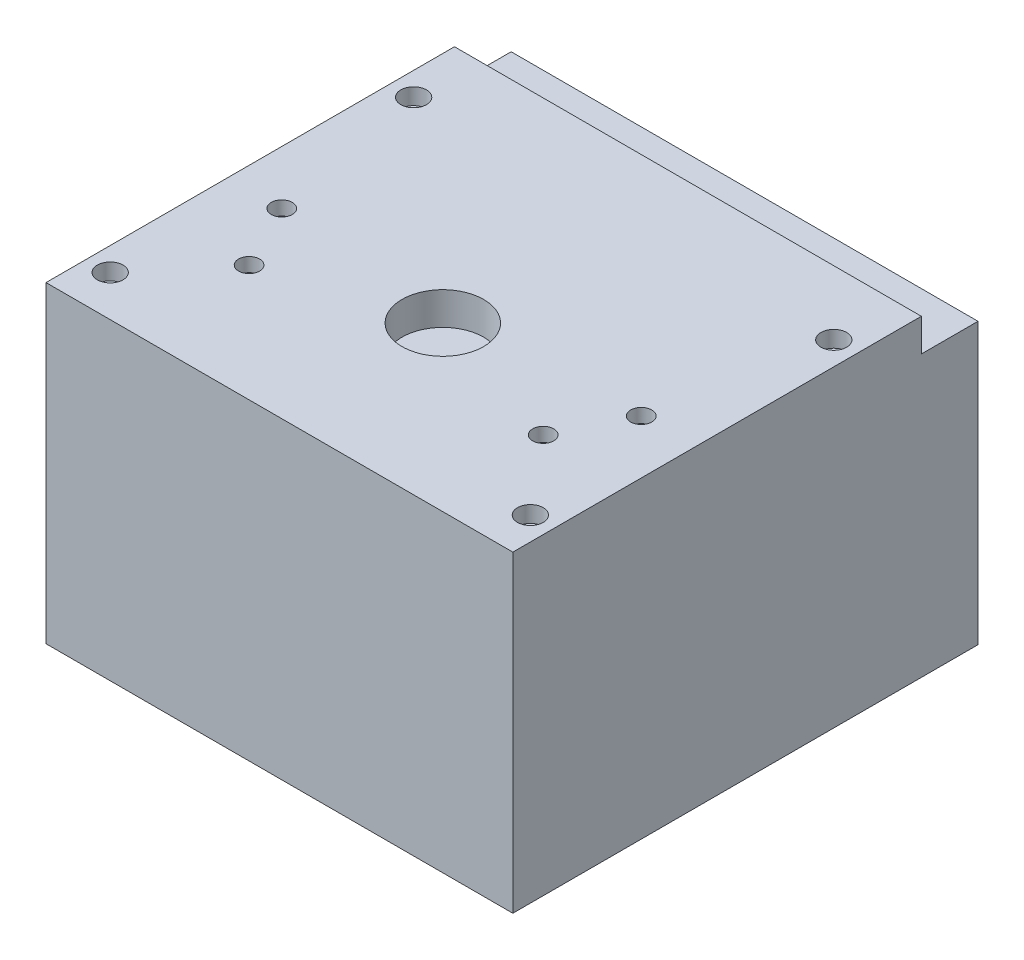
ISO-10303-21;
HEADER;
FILE_DESCRIPTION(('STEP AP214'),'2;1');
FILE_NAME('part.step','',(''),(''),'','','');
FILE_SCHEMA(('AUTOMOTIVE_DESIGN { 1 0 10303 214 1 1 1 1 }'));
ENDSEC;
DATA;
#1=APPLICATION_CONTEXT('core data for automotive mechanical design processes');
#2=APPLICATION_PROTOCOL_DEFINITION('international standard','automotive_design',2000,#1);
#3=PRODUCT_CONTEXT('',#1,'mechanical');
#4=PRODUCT('Part','Part','',(#3));
#5=PRODUCT_RELATED_PRODUCT_CATEGORY('part','',(#4));
#6=PRODUCT_DEFINITION_FORMATION('','',#4);
#7=PRODUCT_DEFINITION_CONTEXT('part definition',#1,'design');
#8=PRODUCT_DEFINITION('design','',#6,#7);
#9=PRODUCT_DEFINITION_SHAPE('','',#8);
#10=(LENGTH_UNIT() NAMED_UNIT(*) SI_UNIT(.MILLI.,.METRE.));
#11=(NAMED_UNIT(*) PLANE_ANGLE_UNIT() SI_UNIT($,.RADIAN.));
#12=(NAMED_UNIT(*) SI_UNIT($,.STERADIAN.) SOLID_ANGLE_UNIT());
#13=UNCERTAINTY_MEASURE_WITH_UNIT(LENGTH_MEASURE(1.E-05),#10,'distance_accuracy_value','');
#14=(GEOMETRIC_REPRESENTATION_CONTEXT(3) GLOBAL_UNCERTAINTY_ASSIGNED_CONTEXT((#13)) GLOBAL_UNIT_ASSIGNED_CONTEXT((#10,
#11,#12)) REPRESENTATION_CONTEXT('',''));
#15=CARTESIAN_POINT('',(0.,0.,0.));
#16=DIRECTION('',(0.,0.,1.));
#17=DIRECTION('',(1.,0.,0.));
#18=AXIS2_PLACEMENT_3D('',#15,#16,#17);
#19=CARTESIAN_POINT('',(90.,14.,-52.5));
#20=DIRECTION('',(0.,-1.,0.));
#21=DIRECTION('',(0.,0.,-1.));
#22=AXIS2_PLACEMENT_3D('',#19,#20,#21);
#23=CYLINDRICAL_SURFACE('',#22,3.25);
#24=CARTESIAN_POINT('',(90.,7.,-52.5));
#25=DIRECTION('',(0.,-1.,0.));
#26=DIRECTION('',(0.,0.,-1.));
#27=AXIS2_PLACEMENT_3D('',#24,#25,#26);
#28=CIRCLE('',#27,3.25);
#29=CARTESIAN_POINT('',(90.,7.,-55.75));
#30=VERTEX_POINT('',#29);
#31=EDGE_CURVE('E183',#30,#30,#28,.T.);
#32=ORIENTED_EDGE('',*,*,#31,.F.);
#33=EDGE_LOOP('',(#32));
#34=FACE_BOUND('',#33,.T.);
#35=CARTESIAN_POINT('',(90.,0.,-52.5));
#36=DIRECTION('',(0.,-1.,0.));
#37=DIRECTION('',(0.,0.,-1.));
#38=AXIS2_PLACEMENT_3D('',#35,#36,#37);
#39=CIRCLE('',#38,3.25);
#40=CARTESIAN_POINT('',(90.,0.,-55.75));
#41=VERTEX_POINT('',#40);
#42=EDGE_CURVE('E205',#41,#41,#39,.T.);
#43=ORIENTED_EDGE('',*,*,#42,.T.);
#44=EDGE_LOOP('',(#43));
#45=FACE_BOUND('',#44,.T.);
#46=ADVANCED_FACE('F37',(#34,#45),#23,.F.);
#47=CARTESIAN_POINT('',(90.,14.,77.5));
#48=DIRECTION('',(0.,-1.,0.));
#49=DIRECTION('',(0.,0.,-1.));
#50=AXIS2_PLACEMENT_3D('',#47,#48,#49);
#51=CYLINDRICAL_SURFACE('',#50,3.25);
#52=CARTESIAN_POINT('',(90.,7.,77.5));
#53=DIRECTION('',(0.,-1.,0.));
#54=DIRECTION('',(0.,0.,-1.));
#55=AXIS2_PLACEMENT_3D('',#52,#53,#54);
#56=CIRCLE('',#55,3.25);
#57=CARTESIAN_POINT('',(90.,7.,74.25));
#58=VERTEX_POINT('',#57);
#59=EDGE_CURVE('E186',#58,#58,#56,.T.);
#60=ORIENTED_EDGE('',*,*,#59,.F.);
#61=EDGE_LOOP('',(#60));
#62=FACE_BOUND('',#61,.T.);
#63=CARTESIAN_POINT('',(90.,0.,77.5));
#64=DIRECTION('',(0.,-1.,0.));
#65=DIRECTION('',(0.,0.,-1.));
#66=AXIS2_PLACEMENT_3D('',#63,#64,#65);
#67=CIRCLE('',#66,3.25);
#68=CARTESIAN_POINT('',(90.,0.,74.25));
#69=VERTEX_POINT('',#68);
#70=EDGE_CURVE('E208',#69,#69,#67,.T.);
#71=ORIENTED_EDGE('',*,*,#70,.T.);
#72=EDGE_LOOP('',(#71));
#73=FACE_BOUND('',#72,.T.);
#74=ADVANCED_FACE('F465',(#62,#73),#51,.F.);
#75=CARTESIAN_POINT('',(-90.,14.,77.5));
#76=DIRECTION('',(0.,-1.,0.));
#77=DIRECTION('',(0.,0.,-1.));
#78=AXIS2_PLACEMENT_3D('',#75,#76,#77);
#79=CYLINDRICAL_SURFACE('',#78,3.25);
#80=CARTESIAN_POINT('',(-90.,7.,77.5));
#81=DIRECTION('',(0.,-1.,0.));
#82=DIRECTION('',(0.,0.,-1.));
#83=AXIS2_PLACEMENT_3D('',#80,#81,#82);
#84=CIRCLE('',#83,3.25);
#85=CARTESIAN_POINT('',(-90.,7.,74.25));
#86=VERTEX_POINT('',#85);
#87=EDGE_CURVE('E189',#86,#86,#84,.T.);
#88=ORIENTED_EDGE('',*,*,#87,.F.);
#89=EDGE_LOOP('',(#88));
#90=FACE_BOUND('',#89,.T.);
#91=CARTESIAN_POINT('',(-90.,0.,77.5));
#92=DIRECTION('',(0.,-1.,0.));
#93=DIRECTION('',(0.,0.,-1.));
#94=AXIS2_PLACEMENT_3D('',#91,#92,#93);
#95=CIRCLE('',#94,3.25);
#96=CARTESIAN_POINT('',(-90.,0.,74.25));
#97=VERTEX_POINT('',#96);
#98=EDGE_CURVE('E211',#97,#97,#95,.T.);
#99=ORIENTED_EDGE('',*,*,#98,.T.);
#100=EDGE_LOOP('',(#99));
#101=FACE_BOUND('',#100,.T.);
#102=ADVANCED_FACE('F455',(#90,#101),#79,.F.);
#103=CARTESIAN_POINT('',(-89.99999999999,14.,-52.5));
#104=DIRECTION('',(0.,-1.,0.));
#105=DIRECTION('',(0.,0.,-1.));
#106=AXIS2_PLACEMENT_3D('',#103,#104,#105);
#107=CYLINDRICAL_SURFACE('',#106,3.25);
#108=CARTESIAN_POINT('',(-89.99999999999,7.,-52.5));
#109=DIRECTION('',(0.,-1.,0.));
#110=DIRECTION('',(0.,0.,-1.));
#111=AXIS2_PLACEMENT_3D('',#108,#109,#110);
#112=CIRCLE('',#111,3.25);
#113=CARTESIAN_POINT('',(-89.99999999999,7.,-55.75));
#114=VERTEX_POINT('',#113);
#115=EDGE_CURVE('E180',#114,#114,#112,.T.);
#116=ORIENTED_EDGE('',*,*,#115,.F.);
#117=EDGE_LOOP('',(#116));
#118=FACE_BOUND('',#117,.T.);
#119=CARTESIAN_POINT('',(-89.99999999999,0.,-52.5));
#120=DIRECTION('',(0.,-1.,0.));
#121=DIRECTION('',(0.,0.,-1.));
#122=AXIS2_PLACEMENT_3D('',#119,#120,#121);
#123=CIRCLE('',#122,3.25);
#124=CARTESIAN_POINT('',(-89.99999999999,0.,-55.75));
#125=VERTEX_POINT('',#124);
#126=EDGE_CURVE('E214',#125,#125,#123,.T.);
#127=ORIENTED_EDGE('',*,*,#126,.T.);
#128=EDGE_LOOP('',(#127));
#129=FACE_BOUND('',#128,.T.);
#130=ADVANCED_FACE('F445',(#118,#129),#107,.F.);
#131=CARTESIAN_POINT('',(-77.,0.,17.));
#132=DIRECTION('',(0.,-1.,0.));
#133=DIRECTION('',(0.,0.,-1.));
#134=AXIS2_PLACEMENT_3D('',#131,#132,#133);
#135=CYLINDRICAL_SURFACE('',#134,7.5);
#136=CARTESIAN_POINT('',(-77.,8.,17.));
#137=DIRECTION('',(0.,-1.,0.));
#138=DIRECTION('',(0.,0.,-1.));
#139=AXIS2_PLACEMENT_3D('',#136,#137,#138);
#140=CIRCLE('',#139,7.5);
#141=CARTESIAN_POINT('',(-77.,8.,9.5));
#142=VERTEX_POINT('',#141);
#143=EDGE_CURVE('E192',#142,#142,#140,.F.);
#144=ORIENTED_EDGE('',*,*,#143,.T.);
#145=EDGE_LOOP('',(#144));
#146=FACE_BOUND('',#145,.T.);
#147=CARTESIAN_POINT('',(-77.,0.,17.));
#148=DIRECTION('',(0.,-1.,0.));
#149=DIRECTION('',(0.,0.,-1.));
#150=AXIS2_PLACEMENT_3D('',#147,#148,#149);
#151=CIRCLE('',#150,7.5);
#152=CARTESIAN_POINT('',(-77.,0.,9.5));
#153=VERTEX_POINT('',#152);
#154=EDGE_CURVE('E217',#153,#153,#151,.T.);
#155=ORIENTED_EDGE('',*,*,#154,.T.);
#156=EDGE_LOOP('',(#155));
#157=FACE_BOUND('',#156,.T.);
#158=ADVANCED_FACE('F435',(#146,#157),#135,.F.);
#159=CARTESIAN_POINT('',(77.,0.,17.));
#160=DIRECTION('',(0.,-1.,0.));
#161=DIRECTION('',(0.,0.,-1.));
#162=AXIS2_PLACEMENT_3D('',#159,#160,#161);
#163=CYLINDRICAL_SURFACE('',#162,7.5);
#164=CARTESIAN_POINT('',(77.,8.,17.));
#165=DIRECTION('',(0.,-1.,0.));
#166=DIRECTION('',(0.,0.,-1.));
#167=AXIS2_PLACEMENT_3D('',#164,#165,#166);
#168=CIRCLE('',#167,7.5);
#169=CARTESIAN_POINT('',(77.,8.,9.5));
#170=VERTEX_POINT('',#169);
#171=EDGE_CURVE('E195',#170,#170,#168,.F.);
#172=ORIENTED_EDGE('',*,*,#171,.T.);
#173=EDGE_LOOP('',(#172));
#174=FACE_BOUND('',#173,.T.);
#175=CARTESIAN_POINT('',(77.,0.,17.));
#176=DIRECTION('',(0.,-1.,0.));
#177=DIRECTION('',(0.,0.,-1.));
#178=AXIS2_PLACEMENT_3D('',#175,#176,#177);
#179=CIRCLE('',#178,7.5);
#180=CARTESIAN_POINT('',(77.,0.,9.5));
#181=VERTEX_POINT('',#180);
#182=EDGE_CURVE('E220',#181,#181,#179,.T.);
#183=ORIENTED_EDGE('',*,*,#182,.T.);
#184=EDGE_LOOP('',(#183));
#185=FACE_BOUND('',#184,.T.);
#186=ADVANCED_FACE('F425',(#174,#185),#163,.F.);
#187=CARTESIAN_POINT('',(63.,0.,45.));
#188=DIRECTION('',(0.,-1.,0.));
#189=DIRECTION('',(0.,0.,-1.));
#190=AXIS2_PLACEMENT_3D('',#187,#188,#189);
#191=CYLINDRICAL_SURFACE('',#190,7.5);
#192=CARTESIAN_POINT('',(63.,8.,45.));
#193=DIRECTION('',(0.,-1.,0.));
#194=DIRECTION('',(0.,0.,-1.));
#195=AXIS2_PLACEMENT_3D('',#192,#193,#194);
#196=CIRCLE('',#195,7.5);
#197=CARTESIAN_POINT('',(63.,8.,37.5));
#198=VERTEX_POINT('',#197);
#199=EDGE_CURVE('E198',#198,#198,#196,.F.);
#200=ORIENTED_EDGE('',*,*,#199,.T.);
#201=EDGE_LOOP('',(#200));
#202=FACE_BOUND('',#201,.T.);
#203=CARTESIAN_POINT('',(63.,0.,45.));
#204=DIRECTION('',(0.,-1.,0.));
#205=DIRECTION('',(0.,0.,-1.));
#206=AXIS2_PLACEMENT_3D('',#203,#204,#205);
#207=CIRCLE('',#206,7.5);
#208=CARTESIAN_POINT('',(63.,0.,37.5));
#209=VERTEX_POINT('',#208);
#210=EDGE_CURVE('E223',#209,#209,#207,.T.);
#211=ORIENTED_EDGE('',*,*,#210,.T.);
#212=EDGE_LOOP('',(#211));
#213=FACE_BOUND('',#212,.T.);
#214=ADVANCED_FACE('F414',(#202,#213),#191,.F.);
#215=CARTESIAN_POINT('',(-63.,0.,45.));
#216=DIRECTION('',(0.,-1.,0.));
#217=DIRECTION('',(0.,0.,-1.));
#218=AXIS2_PLACEMENT_3D('',#215,#216,#217);
#219=CYLINDRICAL_SURFACE('',#218,7.5);
#220=CARTESIAN_POINT('',(-63.,8.,45.));
#221=DIRECTION('',(0.,-1.,0.));
#222=DIRECTION('',(0.,0.,-1.));
#223=AXIS2_PLACEMENT_3D('',#220,#221,#222);
#224=CIRCLE('',#223,7.5);
#225=CARTESIAN_POINT('',(-63.,8.,37.5));
#226=VERTEX_POINT('',#225);
#227=EDGE_CURVE('E201',#226,#226,#224,.F.);
#228=ORIENTED_EDGE('',*,*,#227,.T.);
#229=EDGE_LOOP('',(#228));
#230=FACE_BOUND('',#229,.T.);
#231=CARTESIAN_POINT('',(-63.,0.,45.));
#232=DIRECTION('',(0.,-1.,0.));
#233=DIRECTION('',(0.,0.,-1.));
#234=AXIS2_PLACEMENT_3D('',#231,#232,#233);
#235=CIRCLE('',#234,7.5);
#236=CARTESIAN_POINT('',(-63.,0.,37.5));
#237=VERTEX_POINT('',#236);
#238=EDGE_CURVE('E226',#237,#237,#235,.T.);
#239=ORIENTED_EDGE('',*,*,#238,.T.);
#240=EDGE_LOOP('',(#239));
#241=FACE_BOUND('',#240,.T.);
#242=ADVANCED_FACE('F408',(#230,#241),#219,.F.);
#243=CARTESIAN_POINT('',(-89.99999999999,7.,-52.5));
#244=DIRECTION('',(0.,1.,0.));
#245=DIRECTION('',(0.,0.,1.));
#246=AXIS2_PLACEMENT_3D('',#243,#244,#245);
#247=PLANE('',#246);
#248=CARTESIAN_POINT('',(-89.99999999999,7.,-52.5));
#249=DIRECTION('',(0.,1.,0.));
#250=DIRECTION('',(0.,0.,1.));
#251=AXIS2_PLACEMENT_3D('',#248,#249,#250);
#252=CIRCLE('',#251,5.5);
#253=CARTESIAN_POINT('',(-89.99999999999,7.,-47.));
#254=VERTEX_POINT('',#253);
#255=EDGE_CURVE('E204',#254,#254,#252,.T.);
#256=ORIENTED_EDGE('',*,*,#255,.T.);
#257=EDGE_LOOP('',(#256));
#258=FACE_BOUND('',#257,.T.);
#259=ORIENTED_EDGE('',*,*,#115,.T.);
#260=EDGE_LOOP('',(#259));
#261=FACE_BOUND('',#260,.T.);
#262=ADVANCED_FACE('F413',(#258,#261),#247,.T.);
#263=CARTESIAN_POINT('',(90.,7.,-52.5));
#264=DIRECTION('',(0.,1.,0.));
#265=DIRECTION('',(0.,0.,1.));
#266=AXIS2_PLACEMENT_3D('',#263,#264,#265);
#267=PLANE('',#266);
#268=CARTESIAN_POINT('',(90.,7.,-52.5));
#269=DIRECTION('',(0.,1.,0.));
#270=DIRECTION('',(0.,0.,1.));
#271=AXIS2_PLACEMENT_3D('',#268,#269,#270);
#272=CIRCLE('',#271,5.5);
#273=CARTESIAN_POINT('',(90.,7.,-47.));
#274=VERTEX_POINT('',#273);
#275=EDGE_CURVE('E244',#274,#274,#272,.T.);
#276=ORIENTED_EDGE('',*,*,#275,.T.);
#277=EDGE_LOOP('',(#276));
#278=FACE_BOUND('',#277,.T.);
#279=ORIENTED_EDGE('',*,*,#31,.T.);
#280=EDGE_LOOP('',(#279));
#281=FACE_BOUND('',#280,.T.);
#282=ADVANCED_FACE('F637',(#278,#281),#267,.T.);
#283=CARTESIAN_POINT('',(90.,7.,77.5));
#284=DIRECTION('',(0.,1.,0.));
#285=DIRECTION('',(0.,0.,1.));
#286=AXIS2_PLACEMENT_3D('',#283,#284,#285);
#287=PLANE('',#286);
#288=CARTESIAN_POINT('',(90.,7.,77.5));
#289=DIRECTION('',(0.,1.,0.));
#290=DIRECTION('',(0.,0.,1.));
#291=AXIS2_PLACEMENT_3D('',#288,#289,#290);
#292=CIRCLE('',#291,5.50000000000001);
#293=CARTESIAN_POINT('',(90.,7.,83.));
#294=VERTEX_POINT('',#293);
#295=EDGE_CURVE('E247',#294,#294,#292,.T.);
#296=ORIENTED_EDGE('',*,*,#295,.T.);
#297=EDGE_LOOP('',(#296));
#298=FACE_BOUND('',#297,.T.);
#299=ORIENTED_EDGE('',*,*,#59,.T.);
#300=EDGE_LOOP('',(#299));
#301=FACE_BOUND('',#300,.T.);
#302=ADVANCED_FACE('F641',(#298,#301),#287,.T.);
#303=CARTESIAN_POINT('',(-90.,7.,77.5));
#304=DIRECTION('',(0.,1.,0.));
#305=DIRECTION('',(0.,0.,1.));
#306=AXIS2_PLACEMENT_3D('',#303,#304,#305);
#307=PLANE('',#306);
#308=CARTESIAN_POINT('',(-90.,7.,77.5));
#309=DIRECTION('',(0.,1.,0.));
#310=DIRECTION('',(0.,0.,1.));
#311=AXIS2_PLACEMENT_3D('',#308,#309,#310);
#312=CIRCLE('',#311,5.50000000000001);
#313=CARTESIAN_POINT('',(-90.,7.,83.));
#314=VERTEX_POINT('',#313);
#315=EDGE_CURVE('E250',#314,#314,#312,.T.);
#316=ORIENTED_EDGE('',*,*,#315,.T.);
#317=EDGE_LOOP('',(#316));
#318=FACE_BOUND('',#317,.T.);
#319=ORIENTED_EDGE('',*,*,#87,.T.);
#320=EDGE_LOOP('',(#319));
#321=FACE_BOUND('',#320,.T.);
#322=ADVANCED_FACE('F645',(#318,#321),#307,.T.);
#323=CARTESIAN_POINT('',(-72.5,8.,17.));
#324=DIRECTION('',(0.,1.,0.));
#325=DIRECTION('',(0.,0.,1.));
#326=AXIS2_PLACEMENT_3D('',#323,#324,#325);
#327=PLANE('',#326);
#328=ORIENTED_EDGE('',*,*,#143,.F.);
#329=EDGE_LOOP('',(#328));
#330=FACE_BOUND('',#329,.T.);
#331=CARTESIAN_POINT('',(-77.,8.,17.));
#332=DIRECTION('',(0.,-1.,0.));
#333=DIRECTION('',(0.,0.,-1.));
#334=AXIS2_PLACEMENT_3D('',#331,#332,#333);
#335=CIRCLE('',#334,4.5);
#336=CARTESIAN_POINT('',(-77.,8.,12.5));
#337=VERTEX_POINT('',#336);
#338=EDGE_CURVE('E253',#337,#337,#335,.F.);
#339=ORIENTED_EDGE('',*,*,#338,.T.);
#340=EDGE_LOOP('',(#339));
#341=FACE_BOUND('',#340,.T.);
#342=ADVANCED_FACE('F649',(#330,#341),#327,.F.);
#343=CARTESIAN_POINT('',(81.5,8.,17.));
#344=DIRECTION('',(0.,1.,0.));
#345=DIRECTION('',(0.,0.,1.));
#346=AXIS2_PLACEMENT_3D('',#343,#344,#345);
#347=PLANE('',#346);
#348=ORIENTED_EDGE('',*,*,#171,.F.);
#349=EDGE_LOOP('',(#348));
#350=FACE_BOUND('',#349,.T.);
#351=CARTESIAN_POINT('',(77.,8.,17.));
#352=DIRECTION('',(0.,-1.,0.));
#353=DIRECTION('',(0.,0.,-1.));
#354=AXIS2_PLACEMENT_3D('',#351,#352,#353);
#355=CIRCLE('',#354,4.5);
#356=CARTESIAN_POINT('',(77.,8.,12.5));
#357=VERTEX_POINT('',#356);
#358=EDGE_CURVE('E256',#357,#357,#355,.F.);
#359=ORIENTED_EDGE('',*,*,#358,.T.);
#360=EDGE_LOOP('',(#359));
#361=FACE_BOUND('',#360,.T.);
#362=ADVANCED_FACE('F653',(#350,#361),#347,.F.);
#363=CARTESIAN_POINT('',(67.5,8.,45.));
#364=DIRECTION('',(0.,1.,0.));
#365=DIRECTION('',(0.,0.,1.));
#366=AXIS2_PLACEMENT_3D('',#363,#364,#365);
#367=PLANE('',#366);
#368=ORIENTED_EDGE('',*,*,#199,.F.);
#369=EDGE_LOOP('',(#368));
#370=FACE_BOUND('',#369,.T.);
#371=CARTESIAN_POINT('',(63.,8.,45.));
#372=DIRECTION('',(0.,-1.,0.));
#373=DIRECTION('',(0.,0.,-1.));
#374=AXIS2_PLACEMENT_3D('',#371,#372,#373);
#375=CIRCLE('',#374,4.5);
#376=CARTESIAN_POINT('',(63.,8.,40.5));
#377=VERTEX_POINT('',#376);
#378=EDGE_CURVE('E259',#377,#377,#375,.F.);
#379=ORIENTED_EDGE('',*,*,#378,.T.);
#380=EDGE_LOOP('',(#379));
#381=FACE_BOUND('',#380,.T.);
#382=ADVANCED_FACE('F657',(#370,#381),#367,.F.);
#383=CARTESIAN_POINT('',(-58.5,8.,45.));
#384=DIRECTION('',(0.,1.,0.));
#385=DIRECTION('',(0.,0.,1.));
#386=AXIS2_PLACEMENT_3D('',#383,#384,#385);
#387=PLANE('',#386);
#388=ORIENTED_EDGE('',*,*,#227,.F.);
#389=EDGE_LOOP('',(#388));
#390=FACE_BOUND('',#389,.T.);
#391=CARTESIAN_POINT('',(-63.,8.,45.));
#392=DIRECTION('',(0.,-1.,0.));
#393=DIRECTION('',(0.,0.,-1.));
#394=AXIS2_PLACEMENT_3D('',#391,#392,#393);
#395=CIRCLE('',#394,4.5);
#396=CARTESIAN_POINT('',(-63.,8.,40.5));
#397=VERTEX_POINT('',#396);
#398=EDGE_CURVE('E262',#397,#397,#395,.F.);
#399=ORIENTED_EDGE('',*,*,#398,.T.);
#400=EDGE_LOOP('',(#399));
#401=FACE_BOUND('',#400,.T.);
#402=ADVANCED_FACE('F661',(#390,#401),#387,.F.);
#403=CARTESIAN_POINT('',(-89.99999999999,7.,-52.5));
#404=DIRECTION('',(0.,1.,0.));
#405=DIRECTION('',(0.,0.,1.));
#406=AXIS2_PLACEMENT_3D('',#403,#404,#405);
#407=CYLINDRICAL_SURFACE('',#406,5.5);
#408=ORIENTED_EDGE('',*,*,#255,.F.);
#409=EDGE_LOOP('',(#408));
#410=FACE_BOUND('',#409,.T.);
#411=CARTESIAN_POINT('',(-89.99999999999,14.,-52.5));
#412=DIRECTION('',(0.,1.,0.));
#413=DIRECTION('',(0.,0.,1.));
#414=AXIS2_PLACEMENT_3D('',#411,#412,#413);
#415=CIRCLE('',#414,5.5);
#416=CARTESIAN_POINT('',(-89.99999999999,14.,-47.));
#417=VERTEX_POINT('',#416);
#418=EDGE_CURVE('E160',#417,#417,#415,.F.);
#419=ORIENTED_EDGE('',*,*,#418,.F.);
#420=EDGE_LOOP('',(#419));
#421=FACE_BOUND('',#420,.T.);
#422=ADVANCED_FACE('F665',(#410,#421),#407,.F.);
#423=CARTESIAN_POINT('',(90.,7.,-52.5));
#424=DIRECTION('',(0.,1.,0.));
#425=DIRECTION('',(0.,0.,1.));
#426=AXIS2_PLACEMENT_3D('',#423,#424,#425);
#427=CYLINDRICAL_SURFACE('',#426,5.5);
#428=ORIENTED_EDGE('',*,*,#275,.F.);
#429=EDGE_LOOP('',(#428));
#430=FACE_BOUND('',#429,.T.);
#431=CARTESIAN_POINT('',(90.,14.,-52.5));
#432=DIRECTION('',(0.,1.,0.));
#433=DIRECTION('',(0.,0.,1.));
#434=AXIS2_PLACEMENT_3D('',#431,#432,#433);
#435=CIRCLE('',#434,5.5);
#436=CARTESIAN_POINT('',(90.,14.,-47.));
#437=VERTEX_POINT('',#436);
#438=EDGE_CURVE('E269',#437,#437,#435,.F.);
#439=ORIENTED_EDGE('',*,*,#438,.F.);
#440=EDGE_LOOP('',(#439));
#441=FACE_BOUND('',#440,.T.);
#442=ADVANCED_FACE('F669',(#430,#441),#427,.F.);
#443=CARTESIAN_POINT('',(90.,7.,77.5));
#444=DIRECTION('',(0.,1.,0.));
#445=DIRECTION('',(0.,0.,1.));
#446=AXIS2_PLACEMENT_3D('',#443,#444,#445);
#447=CYLINDRICAL_SURFACE('',#446,5.50000000000001);
#448=ORIENTED_EDGE('',*,*,#295,.F.);
#449=EDGE_LOOP('',(#448));
#450=FACE_BOUND('',#449,.T.);
#451=CARTESIAN_POINT('',(90.,14.,77.5));
#452=DIRECTION('',(0.,1.,0.));
#453=DIRECTION('',(0.,0.,1.));
#454=AXIS2_PLACEMENT_3D('',#451,#452,#453);
#455=CIRCLE('',#454,5.50000000000001);
#456=CARTESIAN_POINT('',(90.,14.,83.));
#457=VERTEX_POINT('',#456);
#458=EDGE_CURVE('E272',#457,#457,#455,.F.);
#459=ORIENTED_EDGE('',*,*,#458,.F.);
#460=EDGE_LOOP('',(#459));
#461=FACE_BOUND('',#460,.T.);
#462=ADVANCED_FACE('F673',(#450,#461),#447,.F.);
#463=CARTESIAN_POINT('',(-90.,7.,77.5));
#464=DIRECTION('',(0.,1.,0.));
#465=DIRECTION('',(0.,0.,1.));
#466=AXIS2_PLACEMENT_3D('',#463,#464,#465);
#467=CYLINDRICAL_SURFACE('',#466,5.50000000000001);
#468=ORIENTED_EDGE('',*,*,#315,.F.);
#469=EDGE_LOOP('',(#468));
#470=FACE_BOUND('',#469,.T.);
#471=CARTESIAN_POINT('',(-90.,14.,77.5));
#472=DIRECTION('',(0.,1.,0.));
#473=DIRECTION('',(0.,0.,1.));
#474=AXIS2_PLACEMENT_3D('',#471,#472,#473);
#475=CIRCLE('',#474,5.50000000000001);
#476=CARTESIAN_POINT('',(-90.,14.,83.));
#477=VERTEX_POINT('',#476);
#478=EDGE_CURVE('E275',#477,#477,#475,.F.);
#479=ORIENTED_EDGE('',*,*,#478,.F.);
#480=EDGE_LOOP('',(#479));
#481=FACE_BOUND('',#480,.T.);
#482=ADVANCED_FACE('F677',(#470,#481),#467,.F.);
#483=CARTESIAN_POINT('',(-77.,0.,17.));
#484=DIRECTION('',(0.,-1.,0.));
#485=DIRECTION('',(0.,0.,-1.));
#486=AXIS2_PLACEMENT_3D('',#483,#484,#485);
#487=CYLINDRICAL_SURFACE('',#486,4.5);
#488=ORIENTED_EDGE('',*,*,#338,.F.);
#489=EDGE_LOOP('',(#488));
#490=FACE_BOUND('',#489,.T.);
#491=CARTESIAN_POINT('',(-77.,14.,17.));
#492=DIRECTION('',(0.,-1.,0.));
#493=DIRECTION('',(0.,0.,-1.));
#494=AXIS2_PLACEMENT_3D('',#491,#492,#493);
#495=CIRCLE('',#494,4.5);
#496=CARTESIAN_POINT('',(-77.,14.,12.5));
#497=VERTEX_POINT('',#496);
#498=EDGE_CURVE('E278',#497,#497,#495,.T.);
#499=ORIENTED_EDGE('',*,*,#498,.F.);
#500=EDGE_LOOP('',(#499));
#501=FACE_BOUND('',#500,.T.);
#502=ADVANCED_FACE('F681',(#490,#501),#487,.F.);
#503=CARTESIAN_POINT('',(77.,0.,17.));
#504=DIRECTION('',(0.,-1.,0.));
#505=DIRECTION('',(0.,0.,-1.));
#506=AXIS2_PLACEMENT_3D('',#503,#504,#505);
#507=CYLINDRICAL_SURFACE('',#506,4.5);
#508=ORIENTED_EDGE('',*,*,#358,.F.);
#509=EDGE_LOOP('',(#508));
#510=FACE_BOUND('',#509,.T.);
#511=CARTESIAN_POINT('',(77.,14.,17.));
#512=DIRECTION('',(0.,-1.,0.));
#513=DIRECTION('',(0.,0.,-1.));
#514=AXIS2_PLACEMENT_3D('',#511,#512,#513);
#515=CIRCLE('',#514,4.5);
#516=CARTESIAN_POINT('',(77.,14.,12.5));
#517=VERTEX_POINT('',#516);
#518=EDGE_CURVE('E281',#517,#517,#515,.T.);
#519=ORIENTED_EDGE('',*,*,#518,.F.);
#520=EDGE_LOOP('',(#519));
#521=FACE_BOUND('',#520,.T.);
#522=ADVANCED_FACE('F685',(#510,#521),#507,.F.);
#523=CARTESIAN_POINT('',(63.,0.,45.));
#524=DIRECTION('',(0.,-1.,0.));
#525=DIRECTION('',(0.,0.,-1.));
#526=AXIS2_PLACEMENT_3D('',#523,#524,#525);
#527=CYLINDRICAL_SURFACE('',#526,4.5);
#528=ORIENTED_EDGE('',*,*,#378,.F.);
#529=EDGE_LOOP('',(#528));
#530=FACE_BOUND('',#529,.T.);
#531=CARTESIAN_POINT('',(63.,14.,45.));
#532=DIRECTION('',(0.,-1.,0.));
#533=DIRECTION('',(0.,0.,-1.));
#534=AXIS2_PLACEMENT_3D('',#531,#532,#533);
#535=CIRCLE('',#534,4.5);
#536=CARTESIAN_POINT('',(63.,14.,40.5));
#537=VERTEX_POINT('',#536);
#538=EDGE_CURVE('E284',#537,#537,#535,.T.);
#539=ORIENTED_EDGE('',*,*,#538,.F.);
#540=EDGE_LOOP('',(#539));
#541=FACE_BOUND('',#540,.T.);
#542=ADVANCED_FACE('F689',(#530,#541),#527,.F.);
#543=CARTESIAN_POINT('',(-63.,0.,45.));
#544=DIRECTION('',(0.,-1.,0.));
#545=DIRECTION('',(0.,0.,-1.));
#546=AXIS2_PLACEMENT_3D('',#543,#544,#545);
#547=CYLINDRICAL_SURFACE('',#546,4.5);
#548=ORIENTED_EDGE('',*,*,#398,.F.);
#549=EDGE_LOOP('',(#548));
#550=FACE_BOUND('',#549,.T.);
#551=CARTESIAN_POINT('',(-63.,14.,45.));
#552=DIRECTION('',(0.,-1.,0.));
#553=DIRECTION('',(0.,0.,-1.));
#554=AXIS2_PLACEMENT_3D('',#551,#552,#553);
#555=CIRCLE('',#554,4.5);
#556=CARTESIAN_POINT('',(-63.,14.,40.5));
#557=VERTEX_POINT('',#556);
#558=EDGE_CURVE('E287',#557,#557,#555,.T.);
#559=ORIENTED_EDGE('',*,*,#558,.F.);
#560=EDGE_LOOP('',(#559));
#561=FACE_BOUND('',#560,.T.);
#562=ADVANCED_FACE('F693',(#550,#561),#547,.F.);
#563=CARTESIAN_POINT('',(3.111619105942E-12,20.,25.));
#564=DIRECTION('',(0.,-1.,0.));
#565=DIRECTION('',(0.,0.,-1.));
#566=AXIS2_PLACEMENT_3D('',#563,#564,#565);
#567=CYLINDRICAL_SURFACE('',#566,17.5);
#568=CARTESIAN_POINT('',(3.111619105942E-12,0.,25.));
#569=DIRECTION('',(0.,-1.,0.));
#570=DIRECTION('',(0.,0.,-1.));
#571=AXIS2_PLACEMENT_3D('',#568,#569,#570);
#572=CIRCLE('',#571,17.5);
#573=CARTESIAN_POINT('',(3.111619105942E-12,0.,7.5));
#574=VERTEX_POINT('',#573);
#575=EDGE_CURVE('E169',#574,#574,#572,.F.);
#576=ORIENTED_EDGE('',*,*,#575,.F.);
#577=EDGE_LOOP('',(#576));
#578=FACE_BOUND('',#577,.T.);
#579=CARTESIAN_POINT('',(3.111619105942E-12,14.,25.));
#580=DIRECTION('',(0.,-1.,0.));
#581=DIRECTION('',(0.,0.,-1.));
#582=AXIS2_PLACEMENT_3D('',#579,#580,#581);
#583=CIRCLE('',#582,17.5);
#584=CARTESIAN_POINT('',(3.111619105942E-12,14.,7.5));
#585=VERTEX_POINT('',#584);
#586=EDGE_CURVE('E159',#585,#585,#583,.T.);
#587=ORIENTED_EDGE('',*,*,#586,.F.);
#588=EDGE_LOOP('',(#587));
#589=FACE_BOUND('',#588,.T.);
#590=ADVANCED_FACE('F697',(#578,#589),#567,.F.);
#591=CARTESIAN_POINT('',(-100.,14.,-80.));
#592=DIRECTION('',(0.,0.,1.));
#593=DIRECTION('',(1.,0.,0.));
#594=AXIS2_PLACEMENT_3D('',#591,#592,#593);
#595=PLANE('',#594);
#596=DIRECTION('',(0.,1.,0.));
#597=VECTOR('',#596,1.);
#598=CARTESIAN_POINT('',(100.,14.,-80.));
#599=LINE('',#598,#597);
#600=CARTESIAN_POINT('',(100.,14.,-80.));
#601=VERTEX_POINT('',#600);
#602=CARTESIAN_POINT('',(100.,0.,-80.));
#603=VERTEX_POINT('',#602);
#604=EDGE_CURVE('E88',#601,#603,#599,.F.);
#605=ORIENTED_EDGE('',*,*,#604,.T.);
#606=DIRECTION('',(1.,0.,0.));
#607=VECTOR('',#606,1.);
#608=CARTESIAN_POINT('',(-100.,0.,-80.));
#609=LINE('',#608,#607);
#610=CARTESIAN_POINT('',(-100.,0.,-80.));
#611=VERTEX_POINT('',#610);
#612=EDGE_CURVE('E167',#611,#603,#609,.T.);
#613=ORIENTED_EDGE('',*,*,#612,.F.);
#614=DIRECTION('',(0.,1.,0.));
#615=VECTOR('',#614,1.);
#616=CARTESIAN_POINT('',(-100.,14.,-80.));
#617=LINE('',#616,#615);
#618=CARTESIAN_POINT('',(-100.,14.,-80.));
#619=VERTEX_POINT('',#618);
#620=EDGE_CURVE('E126',#611,#619,#617,.T.);
#621=ORIENTED_EDGE('',*,*,#620,.T.);
#622=DIRECTION('',(1.,0.,0.));
#623=VECTOR('',#622,1.);
#624=CARTESIAN_POINT('',(-100.,14.,-80.));
#625=LINE('',#624,#623);
#626=EDGE_CURVE('E156',#601,#619,#625,.F.);
#627=ORIENTED_EDGE('',*,*,#626,.F.);
#628=EDGE_LOOP('',(#605,#613,#621,#627));
#629=FACE_BOUND('',#628,.T.);
#630=ADVANCED_FACE('F172',(#629),#595,.F.);
#631=CARTESIAN_POINT('',(-100.,14.,-80.));
#632=DIRECTION('',(1.,0.,0.));
#633=DIRECTION('',(0.,0.,-1.));
#634=AXIS2_PLACEMENT_3D('',#631,#632,#633);
#635=PLANE('',#634);
#636=ORIENTED_EDGE('',*,*,#620,.F.);
#637=DIRECTION('',(0.,0.,-1.));
#638=VECTOR('',#637,1.);
#639=CARTESIAN_POINT('',(-100.,0.,-104.274493179646));
#640=LINE('',#639,#638);
#641=CARTESIAN_POINT('',(-100.,0.,-104.274493179646));
#642=VERTEX_POINT('',#641);
#643=EDGE_CURVE('E150',#611,#642,#640,.T.);
#644=ORIENTED_EDGE('',*,*,#643,.T.);
#645=DIRECTION('',(0.,1.,0.));
#646=VECTOR('',#645,1.);
#647=CARTESIAN_POINT('',(-100.,-120.,-104.274493179646));
#648=LINE('',#647,#646);
#649=CARTESIAN_POINT('',(-100.,-120.,-104.274493179646));
#650=VERTEX_POINT('',#649);
#651=EDGE_CURVE('E135',#650,#642,#648,.T.);
#652=ORIENTED_EDGE('',*,*,#651,.F.);
#653=DIRECTION('',(0.,0.,-1.));
#654=VECTOR('',#653,1.);
#655=CARTESIAN_POINT('',(-100.,-120.,-104.274493179646));
#656=LINE('',#655,#654);
#657=CARTESIAN_POINT('',(-100.,-120.,95.));
#658=VERTEX_POINT('',#657);
#659=EDGE_CURVE('E129',#658,#650,#656,.T.);
#660=ORIENTED_EDGE('',*,*,#659,.F.);
#661=DIRECTION('',(0.,1.,0.));
#662=VECTOR('',#661,1.);
#663=CARTESIAN_POINT('',(-100.,14.,95.));
#664=LINE('',#663,#662);
#665=CARTESIAN_POINT('',(-100.,14.,95.));
#666=VERTEX_POINT('',#665);
#667=EDGE_CURVE('E117',#658,#666,#664,.T.);
#668=ORIENTED_EDGE('',*,*,#667,.T.);
#669=DIRECTION('',(0.,0.,1.));
#670=VECTOR('',#669,1.);
#671=CARTESIAN_POINT('',(-100.,14.,95.));
#672=LINE('',#671,#670);
#673=EDGE_CURVE('E154',#619,#666,#672,.T.);
#674=ORIENTED_EDGE('',*,*,#673,.F.);
#675=EDGE_LOOP('',(#636,#644,#652,#660,#668,#674));
#676=FACE_BOUND('',#675,.T.);
#677=ADVANCED_FACE('F134',(#676),#635,.F.);
#678=CARTESIAN_POINT('',(-100.,14.,95.));
#679=DIRECTION('',(0.,0.,-1.));
#680=DIRECTION('',(-1.,0.,0.));
#681=AXIS2_PLACEMENT_3D('',#678,#679,#680);
#682=PLANE('',#681);
#683=ORIENTED_EDGE('',*,*,#667,.F.);
#684=DIRECTION('',(-1.,0.,0.));
#685=VECTOR('',#684,1.);
#686=CARTESIAN_POINT('',(-100.,-120.,95.));
#687=LINE('',#686,#685);
#688=CARTESIAN_POINT('',(100.,-120.,95.));
#689=VERTEX_POINT('',#688);
#690=EDGE_CURVE('E120',#689,#658,#687,.T.);
#691=ORIENTED_EDGE('',*,*,#690,.F.);
#692=DIRECTION('',(0.,1.,0.));
#693=VECTOR('',#692,1.);
#694=CARTESIAN_POINT('',(100.,14.,95.));
#695=LINE('',#694,#693);
#696=CARTESIAN_POINT('',(100.,14.,95.));
#697=VERTEX_POINT('',#696);
#698=EDGE_CURVE('E57',#689,#697,#695,.T.);
#699=ORIENTED_EDGE('',*,*,#698,.T.);
#700=DIRECTION('',(1.,0.,0.));
#701=VECTOR('',#700,1.);
#702=CARTESIAN_POINT('',(-100.,14.,95.));
#703=LINE('',#702,#701);
#704=EDGE_CURVE('E48',#666,#697,#703,.T.);
#705=ORIENTED_EDGE('',*,*,#704,.F.);
#706=EDGE_LOOP('',(#683,#691,#699,#705));
#707=FACE_BOUND('',#706,.T.);
#708=ADVANCED_FACE('F119',(#707),#682,.F.);
#709=CARTESIAN_POINT('',(100.,14.,-80.));
#710=DIRECTION('',(-1.,0.,0.));
#711=DIRECTION('',(0.,0.,1.));
#712=AXIS2_PLACEMENT_3D('',#709,#710,#711);
#713=PLANE('',#712);
#714=ORIENTED_EDGE('',*,*,#698,.F.);
#715=DIRECTION('',(0.,0.,1.));
#716=VECTOR('',#715,1.);
#717=CARTESIAN_POINT('',(100.,-120.,-104.274493179646));
#718=LINE('',#717,#716);
#719=CARTESIAN_POINT('',(100.,-120.,-104.274493179646));
#720=VERTEX_POINT('',#719);
#721=EDGE_CURVE('E131',#720,#689,#718,.T.);
#722=ORIENTED_EDGE('',*,*,#721,.F.);
#723=DIRECTION('',(0.,1.,0.));
#724=VECTOR('',#723,1.);
#725=CARTESIAN_POINT('',(100.,-120.,-104.274493179646));
#726=LINE('',#725,#724);
#727=CARTESIAN_POINT('',(100.,0.,-104.274493179646));
#728=VERTEX_POINT('',#727);
#729=EDGE_CURVE('E137',#720,#728,#726,.T.);
#730=ORIENTED_EDGE('',*,*,#729,.T.);
#731=DIRECTION('',(0.,0.,1.));
#732=VECTOR('',#731,1.);
#733=CARTESIAN_POINT('',(100.,0.,-104.274493179646));
#734=LINE('',#733,#732);
#735=EDGE_CURVE('E146',#728,#603,#734,.T.);
#736=ORIENTED_EDGE('',*,*,#735,.T.);
#737=ORIENTED_EDGE('',*,*,#604,.F.);
#738=DIRECTION('',(0.,0.,1.));
#739=VECTOR('',#738,1.);
#740=CARTESIAN_POINT('',(100.,14.,95.));
#741=LINE('',#740,#739);
#742=EDGE_CURVE('E11',#697,#601,#741,.F.);
#743=ORIENTED_EDGE('',*,*,#742,.F.);
#744=EDGE_LOOP('',(#714,#722,#730,#736,#737,#743));
#745=FACE_BOUND('',#744,.T.);
#746=ADVANCED_FACE('F177',(#745),#713,.F.);
#747=CARTESIAN_POINT('',(-100.,14.,95.));
#748=DIRECTION('',(0.,1.,0.));
#749=DIRECTION('',(0.,0.,1.));
#750=AXIS2_PLACEMENT_3D('',#747,#748,#749);
#751=PLANE('',#750);
#752=ORIENTED_EDGE('',*,*,#704,.T.);
#753=ORIENTED_EDGE('',*,*,#742,.T.);
#754=ORIENTED_EDGE('',*,*,#626,.T.);
#755=ORIENTED_EDGE('',*,*,#673,.T.);
#756=EDGE_LOOP('',(#752,#753,#754,#755));
#757=FACE_BOUND('',#756,.T.);
#758=ORIENTED_EDGE('',*,*,#586,.T.);
#759=EDGE_LOOP('',(#758));
#760=FACE_BOUND('',#759,.T.);
#761=ORIENTED_EDGE('',*,*,#558,.T.);
#762=EDGE_LOOP('',(#761));
#763=FACE_BOUND('',#762,.T.);
#764=ORIENTED_EDGE('',*,*,#538,.T.);
#765=EDGE_LOOP('',(#764));
#766=FACE_BOUND('',#765,.T.);
#767=ORIENTED_EDGE('',*,*,#518,.T.);
#768=EDGE_LOOP('',(#767));
#769=FACE_BOUND('',#768,.T.);
#770=ORIENTED_EDGE('',*,*,#498,.T.);
#771=EDGE_LOOP('',(#770));
#772=FACE_BOUND('',#771,.T.);
#773=ORIENTED_EDGE('',*,*,#478,.T.);
#774=EDGE_LOOP('',(#773));
#775=FACE_BOUND('',#774,.T.);
#776=ORIENTED_EDGE('',*,*,#458,.T.);
#777=EDGE_LOOP('',(#776));
#778=FACE_BOUND('',#777,.T.);
#779=ORIENTED_EDGE('',*,*,#438,.T.);
#780=EDGE_LOOP('',(#779));
#781=FACE_BOUND('',#780,.T.);
#782=ORIENTED_EDGE('',*,*,#418,.T.);
#783=EDGE_LOOP('',(#782));
#784=FACE_BOUND('',#783,.T.);
#785=ADVANCED_FACE('F175',(#757,#760,#763,#766,#769,#772,#775,#778,#781,#784),#751,.T.);
#786=CARTESIAN_POINT('',(0.,0.,0.));
#787=DIRECTION('',(0.,1.,0.));
#788=DIRECTION('',(0.,0.,1.));
#789=AXIS2_PLACEMENT_3D('',#786,#787,#788);
#790=PLANE('',#789);
#791=ORIENTED_EDGE('',*,*,#42,.F.);
#792=EDGE_LOOP('',(#791));
#793=FACE_BOUND('',#792,.T.);
#794=ADVANCED_FACE('F332',(#793),#790,.T.);
#795=ORIENTED_EDGE('',*,*,#70,.F.);
#796=EDGE_LOOP('',(#795));
#797=FACE_BOUND('',#796,.T.);
#798=ADVANCED_FACE('F539',(#797),#790,.T.);
#799=ORIENTED_EDGE('',*,*,#98,.F.);
#800=EDGE_LOOP('',(#799));
#801=FACE_BOUND('',#800,.T.);
#802=ADVANCED_FACE('F547',(#801),#790,.T.);
#803=ORIENTED_EDGE('',*,*,#126,.F.);
#804=EDGE_LOOP('',(#803));
#805=FACE_BOUND('',#804,.T.);
#806=ADVANCED_FACE('F555',(#805),#790,.T.);
#807=ORIENTED_EDGE('',*,*,#154,.F.);
#808=EDGE_LOOP('',(#807));
#809=FACE_BOUND('',#808,.T.);
#810=ADVANCED_FACE('F563',(#809),#790,.T.);
#811=ORIENTED_EDGE('',*,*,#182,.F.);
#812=EDGE_LOOP('',(#811));
#813=FACE_BOUND('',#812,.T.);
#814=ADVANCED_FACE('F571',(#813),#790,.T.);
#815=ORIENTED_EDGE('',*,*,#210,.F.);
#816=EDGE_LOOP('',(#815));
#817=FACE_BOUND('',#816,.T.);
#818=ADVANCED_FACE('F579',(#817),#790,.T.);
#819=ORIENTED_EDGE('',*,*,#238,.F.);
#820=EDGE_LOOP('',(#819));
#821=FACE_BOUND('',#820,.T.);
#822=ADVANCED_FACE('F330',(#821),#790,.T.);
#823=ORIENTED_EDGE('',*,*,#575,.T.);
#824=EDGE_LOOP('',(#823));
#825=FACE_BOUND('',#824,.T.);
#826=ADVANCED_FACE('F316',(#825),#790,.T.);
#827=ORIENTED_EDGE('',*,*,#643,.F.);
#828=ORIENTED_EDGE('',*,*,#612,.T.);
#829=ORIENTED_EDGE('',*,*,#735,.F.);
#830=DIRECTION('',(1.,0.,0.));
#831=VECTOR('',#830,1.);
#832=CARTESIAN_POINT('',(-100.,0.,-104.274493179646));
#833=LINE('',#832,#831);
#834=EDGE_CURVE('E111',#642,#728,#833,.T.);
#835=ORIENTED_EDGE('',*,*,#834,.F.);
#836=EDGE_LOOP('',(#827,#828,#829,#835));
#837=FACE_BOUND('',#836,.T.);
#838=ADVANCED_FACE('F329',(#837),#790,.T.);
#839=CARTESIAN_POINT('',(-100.,-120.,-104.274493179646));
#840=DIRECTION('',(0.,0.,1.));
#841=DIRECTION('',(1.,0.,0.));
#842=AXIS2_PLACEMENT_3D('',#839,#840,#841);
#843=PLANE('',#842);
#844=ORIENTED_EDGE('',*,*,#834,.T.);
#845=ORIENTED_EDGE('',*,*,#729,.F.);
#846=DIRECTION('',(1.,0.,0.));
#847=VECTOR('',#846,1.);
#848=CARTESIAN_POINT('',(-100.,-120.,-104.274493179646));
#849=LINE('',#848,#847);
#850=EDGE_CURVE('E97',#650,#720,#849,.T.);
#851=ORIENTED_EDGE('',*,*,#850,.F.);
#852=ORIENTED_EDGE('',*,*,#651,.T.);
#853=EDGE_LOOP('',(#844,#845,#851,#852));
#854=FACE_BOUND('',#853,.T.);
#855=ADVANCED_FACE('F378',(#854),#843,.F.);
#856=CARTESIAN_POINT('',(0.,-120.,0.));
#857=DIRECTION('',(0.,1.,0.));
#858=DIRECTION('',(0.,0.,1.));
#859=AXIS2_PLACEMENT_3D('',#856,#857,#858);
#860=PLANE('',#859);
#861=ORIENTED_EDGE('',*,*,#721,.T.);
#862=ORIENTED_EDGE('',*,*,#690,.T.);
#863=ORIENTED_EDGE('',*,*,#659,.T.);
#864=ORIENTED_EDGE('',*,*,#850,.T.);
#865=EDGE_LOOP('',(#861,#862,#863,#864));
#866=FACE_BOUND('',#865,.T.);
#867=ADVANCED_FACE('F128',(#866),#860,.F.);
#868=CLOSED_SHELL('',(#46,#74,#102,#130,#158,#186,#214,#242,#262,#282,#302,#322,#342,#362,#382,
#402,#422,#442,#462,#482,#502,#522,#542,#562,#590,#630,#677,#708,#746,#785,#794,#798,#802,#806,
#810,#814,#818,#822,#826,#838,#855,#867));
#869=CARTESIAN_POINT('',(33.,12.4000000000137,43.));
#870=DIRECTION('',(0.,-1.,0.));
#871=DIRECTION('',(1.,0.,0.));
#872=AXIS2_PLACEMENT_3D('',#869,#870,#871);
#873=CONICAL_SURFACE('',#872,2.10000000005675,1.0297442585896);
#874=CARTESIAN_POINT('',(32.9999999999432,13.6618073001671,43.));
#875=VERTEX_POINT('',#874);
#876=VERTEX_LOOP('',#875);
#877=FACE_BOUND('',#876,.T.);
#878=CARTESIAN_POINT('',(33.,12.4,43.));
#879=DIRECTION('',(0.,-1.,0.));
#880=DIRECTION('',(0.,0.,-1.));
#881=AXIS2_PLACEMENT_3D('',#878,#879,#880);
#882=CIRCLE('',#881,2.1);
#883=CARTESIAN_POINT('',(33.,12.4,40.9));
#884=VERTEX_POINT('',#883);
#885=EDGE_CURVE('E164',#884,#884,#882,.T.);
#886=ORIENTED_EDGE('',*,*,#885,.T.);
#887=EDGE_LOOP('',(#886));
#888=FACE_BOUND('',#887,.T.);
#889=ADVANCED_FACE('F303',(#877,#888),#873,.F.);
#890=CARTESIAN_POINT('',(33.,0.,43.));
#891=DIRECTION('',(0.,-1.,0.));
#892=DIRECTION('',(0.,0.,-1.));
#893=AXIS2_PLACEMENT_3D('',#890,#891,#892);
#894=CYLINDRICAL_SURFACE('',#893,2.1);
#895=ORIENTED_EDGE('',*,*,#885,.F.);
#896=EDGE_LOOP('',(#895));
#897=FACE_BOUND('',#896,.T.);
#898=CARTESIAN_POINT('',(33.,0.,43.));
#899=DIRECTION('',(0.,-1.,0.));
#900=DIRECTION('',(0.,0.,-1.));
#901=AXIS2_PLACEMENT_3D('',#898,#899,#900);
#902=CIRCLE('',#901,2.1);
#903=CARTESIAN_POINT('',(33.,0.,40.9));
#904=VERTEX_POINT('',#903);
#905=EDGE_CURVE('E238',#904,#904,#902,.T.);
#906=ORIENTED_EDGE('',*,*,#905,.T.);
#907=EDGE_LOOP('',(#906));
#908=FACE_BOUND('',#907,.T.);
#909=ADVANCED_FACE('F305',(#897,#908),#894,.F.);
#910=ORIENTED_EDGE('',*,*,#905,.F.);
#911=EDGE_LOOP('',(#910));
#912=FACE_BOUND('',#911,.T.);
#913=ADVANCED_FACE('F308',(#912),#790,.T.);
#914=CLOSED_SHELL('',(#889,#909,#913));
#915=CARTESIAN_POINT('',(33.,12.4000000000137,-23.));
#916=DIRECTION('',(0.,-1.,0.));
#917=DIRECTION('',(1.,0.,0.));
#918=AXIS2_PLACEMENT_3D('',#915,#916,#917);
#919=CONICAL_SURFACE('',#918,2.100000000009,1.02974425867298);
#920=CARTESIAN_POINT('',(33.,13.6618072999966,-23.0000000000246));
#921=VERTEX_POINT('',#920);
#922=VERTEX_LOOP('',#921);
#923=FACE_BOUND('',#922,.T.);
#924=CARTESIAN_POINT('',(33.,12.4,-23.));
#925=DIRECTION('',(0.,-1.,0.));
#926=DIRECTION('',(0.,0.,-1.));
#927=AXIS2_PLACEMENT_3D('',#924,#925,#926);
#928=CIRCLE('',#927,2.1);
#929=CARTESIAN_POINT('',(33.,12.4,-25.1));
#930=VERTEX_POINT('',#929);
#931=EDGE_CURVE('E296',#930,#930,#928,.T.);
#932=ORIENTED_EDGE('',*,*,#931,.T.);
#933=EDGE_LOOP('',(#932));
#934=FACE_BOUND('',#933,.T.);
#935=ADVANCED_FACE('F343',(#923,#934),#919,.F.);
#936=CARTESIAN_POINT('',(33.,0.,-23.));
#937=DIRECTION('',(0.,-1.,0.));
#938=DIRECTION('',(0.,0.,-1.));
#939=AXIS2_PLACEMENT_3D('',#936,#937,#938);
#940=CYLINDRICAL_SURFACE('',#939,2.1);
#941=ORIENTED_EDGE('',*,*,#931,.F.);
#942=EDGE_LOOP('',(#941));
#943=FACE_BOUND('',#942,.T.);
#944=CARTESIAN_POINT('',(33.,0.,-23.));
#945=DIRECTION('',(0.,-1.,0.));
#946=DIRECTION('',(0.,0.,-1.));
#947=AXIS2_PLACEMENT_3D('',#944,#945,#946);
#948=CIRCLE('',#947,2.1);
#949=CARTESIAN_POINT('',(33.,0.,-25.1));
#950=VERTEX_POINT('',#949);
#951=EDGE_CURVE('E235',#950,#950,#948,.T.);
#952=ORIENTED_EDGE('',*,*,#951,.T.);
#953=EDGE_LOOP('',(#952));
#954=FACE_BOUND('',#953,.T.);
#955=ADVANCED_FACE('F324',(#943,#954),#940,.F.);
#956=ORIENTED_EDGE('',*,*,#951,.F.);
#957=EDGE_LOOP('',(#956));
#958=FACE_BOUND('',#957,.T.);
#959=ADVANCED_FACE('F315',(#958),#790,.T.);
#960=CLOSED_SHELL('',(#935,#955,#959));
#961=CARTESIAN_POINT('',(-33.,12.4000000000137,-23.));
#962=DIRECTION('',(0.,-1.,0.));
#963=DIRECTION('',(1.,0.,0.));
#964=AXIS2_PLACEMENT_3D('',#961,#962,#963);
#965=CONICAL_SURFACE('',#964,2.100000000009,1.02974425867298);
#966=CARTESIAN_POINT('',(-33.,13.6618072999966,-23.0000000000246));
#967=VERTEX_POINT('',#966);
#968=VERTEX_LOOP('',#967);
#969=FACE_BOUND('',#968,.T.);
#970=CARTESIAN_POINT('',(-33.,12.4,-23.));
#971=DIRECTION('',(0.,-1.,0.));
#972=DIRECTION('',(0.,0.,-1.));
#973=AXIS2_PLACEMENT_3D('',#970,#971,#972);
#974=CIRCLE('',#973,2.1);
#975=CARTESIAN_POINT('',(-33.,12.4,-25.1));
#976=VERTEX_POINT('',#975);
#977=EDGE_CURVE('E294',#976,#976,#974,.T.);
#978=ORIENTED_EDGE('',*,*,#977,.T.);
#979=EDGE_LOOP('',(#978));
#980=FACE_BOUND('',#979,.T.);
#981=ADVANCED_FACE('F345',(#969,#980),#965,.F.);
#982=CARTESIAN_POINT('',(-33.,0.,-23.));
#983=DIRECTION('',(0.,-1.,0.));
#984=DIRECTION('',(0.,0.,-1.));
#985=AXIS2_PLACEMENT_3D('',#982,#983,#984);
#986=CYLINDRICAL_SURFACE('',#985,2.1);
#987=ORIENTED_EDGE('',*,*,#977,.F.);
#988=EDGE_LOOP('',(#987));
#989=FACE_BOUND('',#988,.T.);
#990=CARTESIAN_POINT('',(-33.,0.,-23.));
#991=DIRECTION('',(0.,-1.,0.));
#992=DIRECTION('',(0.,0.,-1.));
#993=AXIS2_PLACEMENT_3D('',#990,#991,#992);
#994=CIRCLE('',#993,2.1);
#995=CARTESIAN_POINT('',(-33.,0.,-25.1));
#996=VERTEX_POINT('',#995);
#997=EDGE_CURVE('E232',#996,#996,#994,.T.);
#998=ORIENTED_EDGE('',*,*,#997,.T.);
#999=EDGE_LOOP('',(#998));
#1000=FACE_BOUND('',#999,.T.);
#1001=ADVANCED_FACE('F347',(#989,#1000),#986,.F.);
#1002=ORIENTED_EDGE('',*,*,#997,.F.);
#1003=EDGE_LOOP('',(#1002));
#1004=FACE_BOUND('',#1003,.T.);
#1005=ADVANCED_FACE('F326',(#1004),#790,.T.);
#1006=CLOSED_SHELL('',(#981,#1001,#1005));
#1007=CARTESIAN_POINT('',(-33.,12.4000000000137,43.));
#1008=DIRECTION('',(0.,-1.,0.));
#1009=DIRECTION('',(0.,0.,-1.));
#1010=AXIS2_PLACEMENT_3D('',#1007,#1008,#1009);
#1011=CONICAL_SURFACE('',#1010,2.09999999991214,1.02974425859248);
#1012=CARTESIAN_POINT('',(-33.0000000000568,13.6618073000534,43.));
#1013=VERTEX_POINT('',#1012);
#1014=VERTEX_LOOP('',#1013);
#1015=FACE_BOUND('',#1014,.T.);
#1016=CARTESIAN_POINT('',(-33.,12.4,43.));
#1017=DIRECTION('',(0.,-1.,0.));
#1018=DIRECTION('',(0.,0.,-1.));
#1019=AXIS2_PLACEMENT_3D('',#1016,#1017,#1018);
#1020=CIRCLE('',#1019,2.1);
#1021=CARTESIAN_POINT('',(-33.,12.4,40.9));
#1022=VERTEX_POINT('',#1021);
#1023=EDGE_CURVE('E241',#1022,#1022,#1020,.T.);
#1024=ORIENTED_EDGE('',*,*,#1023,.T.);
#1025=EDGE_LOOP('',(#1024));
#1026=FACE_BOUND('',#1025,.T.);
#1027=ADVANCED_FACE('F39',(#1015,#1026),#1011,.F.);
#1028=CARTESIAN_POINT('',(-33.,0.,43.));
#1029=DIRECTION('',(0.,-1.,0.));
#1030=DIRECTION('',(0.,0.,-1.));
#1031=AXIS2_PLACEMENT_3D('',#1028,#1029,#1030);
#1032=CYLINDRICAL_SURFACE('',#1031,2.1);
#1033=ORIENTED_EDGE('',*,*,#1023,.F.);
#1034=EDGE_LOOP('',(#1033));
#1035=FACE_BOUND('',#1034,.T.);
#1036=CARTESIAN_POINT('',(-33.,0.,43.));
#1037=DIRECTION('',(0.,-1.,0.));
#1038=DIRECTION('',(0.,0.,-1.));
#1039=AXIS2_PLACEMENT_3D('',#1036,#1037,#1038);
#1040=CIRCLE('',#1039,2.1);
#1041=CARTESIAN_POINT('',(-33.,0.,40.9));
#1042=VERTEX_POINT('',#1041);
#1043=EDGE_CURVE('E229',#1042,#1042,#1040,.T.);
#1044=ORIENTED_EDGE('',*,*,#1043,.T.);
#1045=EDGE_LOOP('',(#1044));
#1046=FACE_BOUND('',#1045,.T.);
#1047=ADVANCED_FACE('F361',(#1035,#1046),#1032,.F.);
#1048=ORIENTED_EDGE('',*,*,#1043,.F.);
#1049=EDGE_LOOP('',(#1048));
#1050=FACE_BOUND('',#1049,.T.);
#1051=ADVANCED_FACE('F366',(#1050),#790,.T.);
#1052=CLOSED_SHELL('',(#1027,#1047,#1051));
#1053=ORIENTED_CLOSED_SHELL('',*,#914,.T.);
#1054=ORIENTED_CLOSED_SHELL('',*,#960,.T.);
#1055=ORIENTED_CLOSED_SHELL('',*,#1006,.T.);
#1056=ORIENTED_CLOSED_SHELL('',*,#1052,.T.);
#1057=BREP_WITH_VOIDS('B2',#868,(#1053,#1054,#1055,#1056));
#1058=ADVANCED_BREP_SHAPE_REPRESENTATION('',(#18,#1057),#14);
#1059=SHAPE_DEFINITION_REPRESENTATION(#9,#1058);
ENDSEC;
END-ISO-10303-21;
